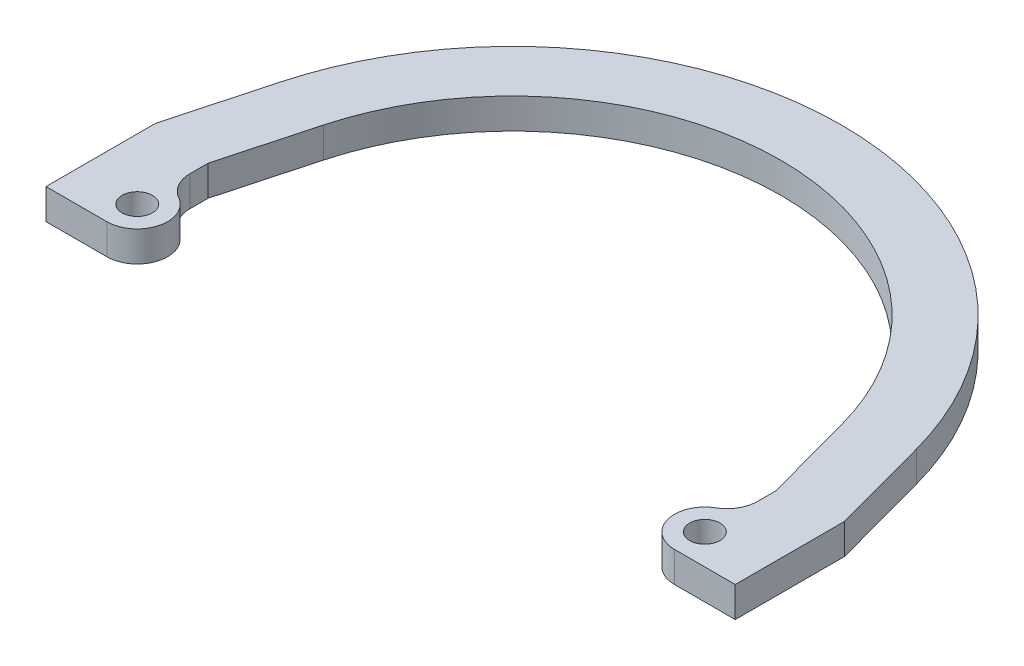
ISO-10303-21;
HEADER;
FILE_DESCRIPTION(('STEP AP214'),'2;1');
FILE_NAME('part.step','',(''),(''),'','','');
FILE_SCHEMA(('AUTOMOTIVE_DESIGN { 1 0 10303 214 1 1 1 1 }'));
ENDSEC;
DATA;
#1=APPLICATION_CONTEXT('core data for automotive mechanical design processes');
#2=APPLICATION_PROTOCOL_DEFINITION('international standard','automotive_design',2000,#1);
#3=PRODUCT_CONTEXT('',#1,'mechanical');
#4=PRODUCT('Part','Part','',(#3));
#5=PRODUCT_RELATED_PRODUCT_CATEGORY('part','',(#4));
#6=PRODUCT_DEFINITION_FORMATION('','',#4);
#7=PRODUCT_DEFINITION_CONTEXT('part definition',#1,'design');
#8=PRODUCT_DEFINITION('design','',#6,#7);
#9=PRODUCT_DEFINITION_SHAPE('','',#8);
#10=(LENGTH_UNIT() NAMED_UNIT(*) SI_UNIT(.MILLI.,.METRE.));
#11=(NAMED_UNIT(*) PLANE_ANGLE_UNIT() SI_UNIT($,.RADIAN.));
#12=(NAMED_UNIT(*) SI_UNIT($,.STERADIAN.) SOLID_ANGLE_UNIT());
#13=UNCERTAINTY_MEASURE_WITH_UNIT(LENGTH_MEASURE(1.E-05),#10,'distance_accuracy_value','');
#14=(GEOMETRIC_REPRESENTATION_CONTEXT(3) GLOBAL_UNCERTAINTY_ASSIGNED_CONTEXT((#13)) GLOBAL_UNIT_ASSIGNED_CONTEXT((#10,
#11,#12)) REPRESENTATION_CONTEXT('',''));
#15=CARTESIAN_POINT('',(0.,0.,0.));
#16=DIRECTION('',(0.,0.,1.));
#17=DIRECTION('',(1.,0.,0.));
#18=AXIS2_PLACEMENT_3D('',#15,#16,#17);
#19=CARTESIAN_POINT('',(0.,3.,0.));
#20=DIRECTION('',(0.,-1.,0.));
#21=DIRECTION('',(0.,0.,-1.));
#22=AXIS2_PLACEMENT_3D('',#19,#20,#21);
#23=PLANE('',#22);
#24=CARTESIAN_POINT('',(-28.,3.,9.));
#25=DIRECTION('',(0.,1.,0.));
#26=DIRECTION('',(0.,0.,1.));
#27=AXIS2_PLACEMENT_3D('',#24,#25,#26);
#28=CIRCLE('',#27,1.5);
#29=CARTESIAN_POINT('',(-28.,3.,10.5));
#30=VERTEX_POINT('',#29);
#31=EDGE_CURVE('E156',#30,#30,#28,.T.);
#32=ORIENTED_EDGE('',*,*,#31,.F.);
#33=EDGE_LOOP('',(#32));
#34=FACE_BOUND('',#33,.T.);
#35=DIRECTION('',(1.,0.,0.));
#36=VECTOR('',#35,1.);
#37=CARTESIAN_POINT('',(29.1,3.,12.));
#38=LINE('',#37,#36);
#39=CARTESIAN_POINT('',(28.,3.,12.));
#40=VERTEX_POINT('',#39);
#41=CARTESIAN_POINT('',(34.,3.,12.));
#42=VERTEX_POINT('',#41);
#43=EDGE_CURVE('E223',#40,#42,#38,.T.);
#44=ORIENTED_EDGE('',*,*,#43,.T.);
#45=DIRECTION('',(0.,0.,-1.));
#46=VECTOR('',#45,1.);
#47=CARTESIAN_POINT('',(34.,3.,12.));
#48=LINE('',#47,#46);
#49=CARTESIAN_POINT('',(34.,3.,1.20071967830535));
#50=VERTEX_POINT('',#49);
#51=EDGE_CURVE('E209',#42,#50,#48,.T.);
#52=ORIENTED_EDGE('',*,*,#51,.T.);
#53=DIRECTION('',(-0.261781254421739,0.,-0.965127232458695));
#54=VECTOR('',#53,1.);
#55=CARTESIAN_POINT('',(34.,3.,1.20071967830535));
#56=LINE('',#55,#54);
#57=CARTESIAN_POINT('',(31.3666350549076,3.,-8.5078907687065));
#58=VERTEX_POINT('',#57);
#59=EDGE_CURVE('E212',#50,#58,#56,.T.);
#60=ORIENTED_EDGE('',*,*,#59,.T.);
#61=CARTESIAN_POINT('',(0.,3.,0.));
#62=DIRECTION('',(0.,1.,0.));
#63=DIRECTION('',(0.,0.,-1.));
#64=AXIS2_PLACEMENT_3D('',#61,#62,#63);
#65=CIRCLE('',#64,32.5);
#66=CARTESIAN_POINT('',(-31.3666350549076,3.,-8.5078907687065));
#67=VERTEX_POINT('',#66);
#68=EDGE_CURVE('E215',#58,#67,#65,.T.);
#69=ORIENTED_EDGE('',*,*,#68,.T.);
#70=DIRECTION('',(0.261781254421739,0.,-0.965127232458695));
#71=VECTOR('',#70,1.);
#72=CARTESIAN_POINT('',(-34.,3.,1.20071967830535));
#73=LINE('',#72,#71);
#74=CARTESIAN_POINT('',(-34.,3.,1.20071967830535));
#75=VERTEX_POINT('',#74);
#76=EDGE_CURVE('E174',#75,#67,#73,.T.);
#77=ORIENTED_EDGE('',*,*,#76,.F.);
#78=DIRECTION('',(0.,0.,-1.));
#79=VECTOR('',#78,1.);
#80=CARTESIAN_POINT('',(-34.,3.,12.));
#81=LINE('',#80,#79);
#82=CARTESIAN_POINT('',(-34.,3.,12.));
#83=VERTEX_POINT('',#82);
#84=EDGE_CURVE('E170',#83,#75,#81,.T.);
#85=ORIENTED_EDGE('',*,*,#84,.F.);
#86=DIRECTION('',(-1.,0.,0.));
#87=VECTOR('',#86,1.);
#88=CARTESIAN_POINT('',(-29.1,3.,12.));
#89=LINE('',#88,#87);
#90=CARTESIAN_POINT('',(-28.,3.,12.));
#91=VERTEX_POINT('',#90);
#92=EDGE_CURVE('E180',#91,#83,#89,.T.);
#93=ORIENTED_EDGE('',*,*,#92,.F.);
#94=CARTESIAN_POINT('',(-28.,3.,9.));
#95=DIRECTION('',(0.,1.,0.));
#96=DIRECTION('',(0.,0.,-1.));
#97=AXIS2_PLACEMENT_3D('',#94,#95,#96);
#98=CIRCLE('',#97,3.);
#99=CARTESIAN_POINT('',(-26.5,3.,6.40192378864668));
#100=VERTEX_POINT('',#99);
#101=EDGE_CURVE('E155',#91,#100,#98,.T.);
#102=ORIENTED_EDGE('',*,*,#101,.T.);
#103=CARTESIAN_POINT('',(-25.,3.,3.80384757729337));
#104=DIRECTION('',(0.,1.,0.));
#105=DIRECTION('',(0.,0.,-1.));
#106=AXIS2_PLACEMENT_3D('',#103,#104,#105);
#107=CIRCLE('',#106,3.);
#108=CARTESIAN_POINT('',(-28.,3.,3.80384757729337));
#109=VERTEX_POINT('',#108);
#110=EDGE_CURVE('E199',#109,#100,#107,.T.);
#111=ORIENTED_EDGE('',*,*,#110,.F.);
#112=DIRECTION('',(0.,0.,1.));
#113=VECTOR('',#112,1.);
#114=CARTESIAN_POINT('',(-28.,3.,12.));
#115=LINE('',#114,#113);
#116=CARTESIAN_POINT('',(-28.,3.,2.));
#117=VERTEX_POINT('',#116);
#118=EDGE_CURVE('E510',#117,#109,#115,.T.);
#119=ORIENTED_EDGE('',*,*,#118,.F.);
#120=DIRECTION('',(-0.261781254421738,0.,0.965127232458696));
#121=VECTOR('',#120,1.);
#122=CARTESIAN_POINT('',(-28.,3.,2.));
#123=LINE('',#122,#121);
#124=CARTESIAN_POINT('',(-25.5758716601554,3.,-6.93720324217607));
#125=VERTEX_POINT('',#124);
#126=EDGE_CURVE('E508',#125,#117,#123,.T.);
#127=ORIENTED_EDGE('',*,*,#126,.F.);
#128=CARTESIAN_POINT('',(0.,3.,0.));
#129=DIRECTION('',(0.,-1.,0.));
#130=DIRECTION('',(0.,0.,-1.));
#131=AXIS2_PLACEMENT_3D('',#128,#129,#130);
#132=CIRCLE('',#131,26.5);
#133=CARTESIAN_POINT('',(25.5758716601554,3.,-6.93720324217607));
#134=VERTEX_POINT('',#133);
#135=EDGE_CURVE('E217',#125,#134,#132,.T.);
#136=ORIENTED_EDGE('',*,*,#135,.T.);
#137=DIRECTION('',(0.261781254421738,0.,0.965127232458696));
#138=VECTOR('',#137,1.);
#139=CARTESIAN_POINT('',(28.,3.,2.));
#140=LINE('',#139,#138);
#141=CARTESIAN_POINT('',(28.,3.,2.));
#142=VERTEX_POINT('',#141);
#143=EDGE_CURVE('E219',#134,#142,#140,.T.);
#144=ORIENTED_EDGE('',*,*,#143,.T.);
#145=DIRECTION('',(0.,0.,1.));
#146=VECTOR('',#145,1.);
#147=CARTESIAN_POINT('',(28.,3.,12.));
#148=LINE('',#147,#146);
#149=CARTESIAN_POINT('',(28.,3.,3.80384757729337));
#150=VERTEX_POINT('',#149);
#151=EDGE_CURVE('E221',#142,#150,#148,.T.);
#152=ORIENTED_EDGE('',*,*,#151,.T.);
#153=CARTESIAN_POINT('',(25.,3.,3.80384757729337));
#154=DIRECTION('',(0.,-1.,0.));
#155=DIRECTION('',(0.,0.,-1.));
#156=AXIS2_PLACEMENT_3D('',#153,#154,#155);
#157=CIRCLE('',#156,3.);
#158=CARTESIAN_POINT('',(26.5,3.,6.40192378864668));
#159=VERTEX_POINT('',#158);
#160=EDGE_CURVE('E11',#150,#159,#157,.T.);
#161=ORIENTED_EDGE('',*,*,#160,.T.);
#162=CARTESIAN_POINT('',(28.,3.,9.));
#163=DIRECTION('',(0.,-1.,0.));
#164=DIRECTION('',(0.,0.,-1.));
#165=AXIS2_PLACEMENT_3D('',#162,#163,#164);
#166=CIRCLE('',#165,3.);
#167=EDGE_CURVE('E203',#40,#159,#166,.T.);
#168=ORIENTED_EDGE('',*,*,#167,.F.);
#169=EDGE_LOOP('',(#44,#52,#60,#69,#77,#85,#93,#102,#111,#119,#127,#136,#144,#152,#161,#168));
#170=FACE_BOUND('',#169,.T.);
#171=CARTESIAN_POINT('',(28.,3.,9.));
#172=DIRECTION('',(0.,1.,0.));
#173=DIRECTION('',(0.,0.,1.));
#174=AXIS2_PLACEMENT_3D('',#171,#172,#173);
#175=CIRCLE('',#174,1.5);
#176=CARTESIAN_POINT('',(28.,3.,10.5));
#177=VERTEX_POINT('',#176);
#178=EDGE_CURVE('E492',#177,#177,#175,.T.);
#179=ORIENTED_EDGE('',*,*,#178,.F.);
#180=EDGE_LOOP('',(#179));
#181=FACE_BOUND('',#180,.T.);
#182=ADVANCED_FACE('F32',(#34,#170,#181),#23,.F.);
#183=CARTESIAN_POINT('',(0.,0.,0.));
#184=DIRECTION('',(0.,-1.,0.));
#185=DIRECTION('',(0.,0.,-1.));
#186=AXIS2_PLACEMENT_3D('',#183,#184,#185);
#187=PLANE('',#186);
#188=CARTESIAN_POINT('',(-28.,0.,9.));
#189=DIRECTION('',(0.,1.,0.));
#190=DIRECTION('',(0.,0.,1.));
#191=AXIS2_PLACEMENT_3D('',#188,#189,#190);
#192=CIRCLE('',#191,1.5);
#193=CARTESIAN_POINT('',(-28.,0.,10.5));
#194=VERTEX_POINT('',#193);
#195=EDGE_CURVE('E497',#194,#194,#192,.T.);
#196=ORIENTED_EDGE('',*,*,#195,.T.);
#197=EDGE_LOOP('',(#196));
#198=FACE_BOUND('',#197,.T.);
#199=DIRECTION('',(1.,0.,0.));
#200=VECTOR('',#199,1.);
#201=CARTESIAN_POINT('',(32.9,0.,12.));
#202=LINE('',#201,#200);
#203=CARTESIAN_POINT('',(28.,0.,12.));
#204=VERTEX_POINT('',#203);
#205=CARTESIAN_POINT('',(34.,0.,12.));
#206=VERTEX_POINT('',#205);
#207=EDGE_CURVE('E213',#204,#206,#202,.T.);
#208=ORIENTED_EDGE('',*,*,#207,.F.);
#209=CARTESIAN_POINT('',(28.,0.,9.));
#210=DIRECTION('',(0.,1.,0.));
#211=DIRECTION('',(0.,0.,-1.));
#212=AXIS2_PLACEMENT_3D('',#209,#210,#211);
#213=CIRCLE('',#212,3.);
#214=CARTESIAN_POINT('',(26.5,0.,6.40192378864668));
#215=VERTEX_POINT('',#214);
#216=EDGE_CURVE('E202',#215,#204,#213,.T.);
#217=ORIENTED_EDGE('',*,*,#216,.F.);
#218=CARTESIAN_POINT('',(25.,0.,3.80384757729337));
#219=DIRECTION('',(0.,-1.,0.));
#220=DIRECTION('',(0.,0.,-1.));
#221=AXIS2_PLACEMENT_3D('',#218,#219,#220);
#222=CIRCLE('',#221,3.);
#223=CARTESIAN_POINT('',(28.,0.,3.80384757729337));
#224=VERTEX_POINT('',#223);
#225=EDGE_CURVE('E40',#215,#224,#222,.F.);
#226=ORIENTED_EDGE('',*,*,#225,.T.);
#227=DIRECTION('',(0.,0.,1.));
#228=VECTOR('',#227,1.);
#229=CARTESIAN_POINT('',(28.,0.,12.));
#230=LINE('',#229,#228);
#231=CARTESIAN_POINT('',(28.,0.,2.));
#232=VERTEX_POINT('',#231);
#233=EDGE_CURVE('E236',#232,#224,#230,.T.);
#234=ORIENTED_EDGE('',*,*,#233,.F.);
#235=DIRECTION('',(0.261781254421738,0.,0.965127232458696));
#236=VECTOR('',#235,1.);
#237=CARTESIAN_POINT('',(28.,0.,2.));
#238=LINE('',#237,#236);
#239=CARTESIAN_POINT('',(25.5758716601554,0.,-6.93720324217607));
#240=VERTEX_POINT('',#239);
#241=EDGE_CURVE('E234',#240,#232,#238,.T.);
#242=ORIENTED_EDGE('',*,*,#241,.F.);
#243=CARTESIAN_POINT('',(0.,0.,0.));
#244=DIRECTION('',(0.,-1.,0.));
#245=DIRECTION('',(0.,0.,-1.));
#246=AXIS2_PLACEMENT_3D('',#243,#244,#245);
#247=CIRCLE('',#246,26.5);
#248=CARTESIAN_POINT('',(-25.5758716601554,0.,-6.93720324217607));
#249=VERTEX_POINT('',#248);
#250=EDGE_CURVE('E232',#249,#240,#247,.T.);
#251=ORIENTED_EDGE('',*,*,#250,.F.);
#252=DIRECTION('',(-0.261781254421738,0.,0.965127232458696));
#253=VECTOR('',#252,1.);
#254=CARTESIAN_POINT('',(-28.,0.,2.));
#255=LINE('',#254,#253);
#256=CARTESIAN_POINT('',(-28.,0.,2.));
#257=VERTEX_POINT('',#256);
#258=EDGE_CURVE('E176',#249,#257,#255,.T.);
#259=ORIENTED_EDGE('',*,*,#258,.T.);
#260=DIRECTION('',(0.,0.,1.));
#261=VECTOR('',#260,1.);
#262=CARTESIAN_POINT('',(-28.,0.,12.));
#263=LINE('',#262,#261);
#264=CARTESIAN_POINT('',(-28.,0.,3.80384757729337));
#265=VERTEX_POINT('',#264);
#266=EDGE_CURVE('E171',#257,#265,#263,.T.);
#267=ORIENTED_EDGE('',*,*,#266,.T.);
#268=CARTESIAN_POINT('',(-25.,0.,3.80384757729337));
#269=DIRECTION('',(0.,1.,0.));
#270=DIRECTION('',(0.,0.,-1.));
#271=AXIS2_PLACEMENT_3D('',#268,#269,#270);
#272=CIRCLE('',#271,3.);
#273=CARTESIAN_POINT('',(-26.5,0.,6.40192378864668));
#274=VERTEX_POINT('',#273);
#275=EDGE_CURVE('E153',#274,#265,#272,.F.);
#276=ORIENTED_EDGE('',*,*,#275,.F.);
#277=CARTESIAN_POINT('',(-28.,0.,9.));
#278=DIRECTION('',(0.,-1.,0.));
#279=DIRECTION('',(0.,0.,-1.));
#280=AXIS2_PLACEMENT_3D('',#277,#278,#279);
#281=CIRCLE('',#280,3.);
#282=CARTESIAN_POINT('',(-28.,0.,12.));
#283=VERTEX_POINT('',#282);
#284=EDGE_CURVE('E144',#274,#283,#281,.T.);
#285=ORIENTED_EDGE('',*,*,#284,.T.);
#286=DIRECTION('',(-1.,0.,0.));
#287=VECTOR('',#286,1.);
#288=CARTESIAN_POINT('',(-29.1,0.,12.));
#289=LINE('',#288,#287);
#290=CARTESIAN_POINT('',(-34.,0.,12.));
#291=VERTEX_POINT('',#290);
#292=EDGE_CURVE('E150',#283,#291,#289,.T.);
#293=ORIENTED_EDGE('',*,*,#292,.T.);
#294=DIRECTION('',(0.,0.,-1.));
#295=VECTOR('',#294,1.);
#296=CARTESIAN_POINT('',(-34.,0.,12.));
#297=LINE('',#296,#295);
#298=CARTESIAN_POINT('',(-34.,0.,1.20071967830535));
#299=VERTEX_POINT('',#298);
#300=EDGE_CURVE('E504',#291,#299,#297,.T.);
#301=ORIENTED_EDGE('',*,*,#300,.T.);
#302=DIRECTION('',(0.261781254421739,0.,-0.965127232458695));
#303=VECTOR('',#302,1.);
#304=CARTESIAN_POINT('',(-34.,0.,1.20071967830535));
#305=LINE('',#304,#303);
#306=CARTESIAN_POINT('',(-31.3666350549076,0.,-8.5078907687065));
#307=VERTEX_POINT('',#306);
#308=EDGE_CURVE('E515',#299,#307,#305,.T.);
#309=ORIENTED_EDGE('',*,*,#308,.T.);
#310=CARTESIAN_POINT('',(0.,0.,0.));
#311=DIRECTION('',(0.,1.,0.));
#312=DIRECTION('',(0.,0.,-1.));
#313=AXIS2_PLACEMENT_3D('',#310,#311,#312);
#314=CIRCLE('',#313,32.5);
#315=CARTESIAN_POINT('',(31.3666350549076,0.,-8.5078907687065));
#316=VERTEX_POINT('',#315);
#317=EDGE_CURVE('E230',#316,#307,#314,.T.);
#318=ORIENTED_EDGE('',*,*,#317,.F.);
#319=DIRECTION('',(-0.261781254421739,0.,-0.965127232458695));
#320=VECTOR('',#319,1.);
#321=CARTESIAN_POINT('',(34.,0.,1.20071967830535));
#322=LINE('',#321,#320);
#323=CARTESIAN_POINT('',(34.,0.,1.20071967830535));
#324=VERTEX_POINT('',#323);
#325=EDGE_CURVE('E228',#324,#316,#322,.T.);
#326=ORIENTED_EDGE('',*,*,#325,.F.);
#327=DIRECTION('',(0.,0.,-1.));
#328=VECTOR('',#327,1.);
#329=CARTESIAN_POINT('',(34.,0.,12.));
#330=LINE('',#329,#328);
#331=EDGE_CURVE('E206',#206,#324,#330,.T.);
#332=ORIENTED_EDGE('',*,*,#331,.F.);
#333=EDGE_LOOP('',(#208,#217,#226,#234,#242,#251,#259,#267,#276,#285,#293,#301,#309,#318,#326,#332));
#334=FACE_BOUND('',#333,.T.);
#335=CARTESIAN_POINT('',(28.,0.,9.));
#336=DIRECTION('',(0.,1.,0.));
#337=DIRECTION('',(0.,0.,1.));
#338=AXIS2_PLACEMENT_3D('',#335,#336,#337);
#339=CIRCLE('',#338,1.5);
#340=CARTESIAN_POINT('',(28.,0.,10.5));
#341=VERTEX_POINT('',#340);
#342=EDGE_CURVE('E495',#341,#341,#339,.T.);
#343=ORIENTED_EDGE('',*,*,#342,.T.);
#344=EDGE_LOOP('',(#343));
#345=FACE_BOUND('',#344,.T.);
#346=ADVANCED_FACE('F146',(#198,#334,#345),#187,.T.);
#347=CARTESIAN_POINT('',(28.,3.,12.));
#348=DIRECTION('',(1.,0.,0.));
#349=DIRECTION('',(0.,0.,-1.));
#350=AXIS2_PLACEMENT_3D('',#347,#348,#349);
#351=PLANE('',#350);
#352=ORIENTED_EDGE('',*,*,#233,.T.);
#353=DIRECTION('',(0.,1.,0.));
#354=VECTOR('',#353,1.);
#355=CARTESIAN_POINT('',(28.,3.,3.80384757729337));
#356=LINE('',#355,#354);
#357=EDGE_CURVE('E53',#224,#150,#356,.T.);
#358=ORIENTED_EDGE('',*,*,#357,.T.);
#359=ORIENTED_EDGE('',*,*,#151,.F.);
#360=DIRECTION('',(0.,-1.,0.));
#361=VECTOR('',#360,1.);
#362=CARTESIAN_POINT('',(28.,3.,2.));
#363=LINE('',#362,#361);
#364=EDGE_CURVE('E244',#142,#232,#363,.T.);
#365=ORIENTED_EDGE('',*,*,#364,.T.);
#366=EDGE_LOOP('',(#352,#358,#359,#365));
#367=FACE_BOUND('',#366,.T.);
#368=ADVANCED_FACE('F295',(#367),#351,.F.);
#369=CARTESIAN_POINT('',(34.,3.,12.));
#370=DIRECTION('',(-1.,0.,0.));
#371=DIRECTION('',(0.,0.,1.));
#372=AXIS2_PLACEMENT_3D('',#369,#370,#371);
#373=PLANE('',#372);
#374=ORIENTED_EDGE('',*,*,#331,.T.);
#375=DIRECTION('',(0.,-1.,0.));
#376=VECTOR('',#375,1.);
#377=CARTESIAN_POINT('',(34.,3.,1.20071967830535));
#378=LINE('',#377,#376);
#379=EDGE_CURVE('E253',#50,#324,#378,.T.);
#380=ORIENTED_EDGE('',*,*,#379,.F.);
#381=ORIENTED_EDGE('',*,*,#51,.F.);
#382=DIRECTION('',(0.,-1.,0.));
#383=VECTOR('',#382,1.);
#384=CARTESIAN_POINT('',(34.,3.,12.));
#385=LINE('',#384,#383);
#386=EDGE_CURVE('E225',#42,#206,#385,.T.);
#387=ORIENTED_EDGE('',*,*,#386,.T.);
#388=EDGE_LOOP('',(#374,#380,#381,#387));
#389=FACE_BOUND('',#388,.T.);
#390=ADVANCED_FACE('F272',(#389),#373,.F.);
#391=CARTESIAN_POINT('',(34.,3.,1.20071967830535));
#392=DIRECTION('',(-0.965127232458696,0.,0.261781254421739));
#393=DIRECTION('',(0.261781254421739,0.,0.965127232458696));
#394=AXIS2_PLACEMENT_3D('',#391,#392,#393);
#395=PLANE('',#394);
#396=ORIENTED_EDGE('',*,*,#325,.T.);
#397=DIRECTION('',(0.,-1.,0.));
#398=VECTOR('',#397,1.);
#399=CARTESIAN_POINT('',(31.3666350549076,3.,-8.5078907687065));
#400=LINE('',#399,#398);
#401=EDGE_CURVE('E250',#58,#316,#400,.T.);
#402=ORIENTED_EDGE('',*,*,#401,.F.);
#403=ORIENTED_EDGE('',*,*,#59,.F.);
#404=ORIENTED_EDGE('',*,*,#379,.T.);
#405=EDGE_LOOP('',(#396,#402,#403,#404));
#406=FACE_BOUND('',#405,.T.);
#407=ADVANCED_FACE('F316',(#406),#395,.F.);
#408=CARTESIAN_POINT('',(0.,3.,0.));
#409=DIRECTION('',(0.,-1.,0.));
#410=DIRECTION('',(0.,0.,-1.));
#411=AXIS2_PLACEMENT_3D('',#408,#409,#410);
#412=CYLINDRICAL_SURFACE('',#411,32.5);
#413=ORIENTED_EDGE('',*,*,#317,.T.);
#414=DIRECTION('',(0.,-1.,0.));
#415=VECTOR('',#414,1.);
#416=CARTESIAN_POINT('',(-31.3666350549076,3.,-8.5078907687065));
#417=LINE('',#416,#415);
#418=EDGE_CURVE('E187',#67,#307,#417,.T.);
#419=ORIENTED_EDGE('',*,*,#418,.F.);
#420=ORIENTED_EDGE('',*,*,#68,.F.);
#421=ORIENTED_EDGE('',*,*,#401,.T.);
#422=EDGE_LOOP('',(#413,#419,#420,#421));
#423=FACE_BOUND('',#422,.T.);
#424=ADVANCED_FACE('F312',(#423),#412,.T.);
#425=CARTESIAN_POINT('',(0.,3.,0.));
#426=DIRECTION('',(0.,-1.,0.));
#427=DIRECTION('',(0.,0.,-1.));
#428=AXIS2_PLACEMENT_3D('',#425,#426,#427);
#429=CYLINDRICAL_SURFACE('',#428,26.5);
#430=ORIENTED_EDGE('',*,*,#250,.T.);
#431=DIRECTION('',(0.,-1.,0.));
#432=VECTOR('',#431,1.);
#433=CARTESIAN_POINT('',(25.5758716601554,3.,-6.93720324217607));
#434=LINE('',#433,#432);
#435=EDGE_CURVE('E247',#134,#240,#434,.T.);
#436=ORIENTED_EDGE('',*,*,#435,.F.);
#437=ORIENTED_EDGE('',*,*,#135,.F.);
#438=DIRECTION('',(0.,-1.,0.));
#439=VECTOR('',#438,1.);
#440=CARTESIAN_POINT('',(-25.5758716601554,3.,-6.93720324217607));
#441=LINE('',#440,#439);
#442=EDGE_CURVE('E184',#125,#249,#441,.T.);
#443=ORIENTED_EDGE('',*,*,#442,.T.);
#444=EDGE_LOOP('',(#430,#436,#437,#443));
#445=FACE_BOUND('',#444,.T.);
#446=ADVANCED_FACE('F308',(#445),#429,.F.);
#447=CARTESIAN_POINT('',(28.,3.,2.));
#448=DIRECTION('',(0.965127232458696,0.,-0.261781254421738));
#449=DIRECTION('',(-0.261781254421738,0.,-0.965127232458696));
#450=AXIS2_PLACEMENT_3D('',#447,#448,#449);
#451=PLANE('',#450);
#452=ORIENTED_EDGE('',*,*,#241,.T.);
#453=ORIENTED_EDGE('',*,*,#364,.F.);
#454=ORIENTED_EDGE('',*,*,#143,.F.);
#455=ORIENTED_EDGE('',*,*,#435,.T.);
#456=EDGE_LOOP('',(#452,#453,#454,#455));
#457=FACE_BOUND('',#456,.T.);
#458=ADVANCED_FACE('F303',(#457),#451,.F.);
#459=CARTESIAN_POINT('',(32.9,3.,12.));
#460=DIRECTION('',(0.,0.,-1.));
#461=DIRECTION('',(-1.,0.,0.));
#462=AXIS2_PLACEMENT_3D('',#459,#460,#461);
#463=PLANE('',#462);
#464=ORIENTED_EDGE('',*,*,#207,.T.);
#465=ORIENTED_EDGE('',*,*,#386,.F.);
#466=ORIENTED_EDGE('',*,*,#43,.F.);
#467=DIRECTION('',(0.,-1.,0.));
#468=VECTOR('',#467,1.);
#469=CARTESIAN_POINT('',(28.,3.,12.));
#470=LINE('',#469,#468);
#471=EDGE_CURVE('E241',#40,#204,#470,.T.);
#472=ORIENTED_EDGE('',*,*,#471,.T.);
#473=EDGE_LOOP('',(#464,#465,#466,#472));
#474=FACE_BOUND('',#473,.T.);
#475=ADVANCED_FACE('F269',(#474),#463,.F.);
#476=CARTESIAN_POINT('',(28.,9.70820393249937,9.));
#477=DIRECTION('',(0.,-1.,0.));
#478=DIRECTION('',(0.,0.,-1.));
#479=AXIS2_PLACEMENT_3D('',#476,#477,#478);
#480=CYLINDRICAL_SURFACE('',#479,3.);
#481=ORIENTED_EDGE('',*,*,#167,.T.);
#482=DIRECTION('',(0.,-1.,0.));
#483=VECTOR('',#482,1.);
#484=CARTESIAN_POINT('',(26.5,9.70820393249937,6.40192378864668));
#485=LINE('',#484,#483);
#486=EDGE_CURVE('E256',#159,#215,#485,.T.);
#487=ORIENTED_EDGE('',*,*,#486,.T.);
#488=ORIENTED_EDGE('',*,*,#216,.T.);
#489=ORIENTED_EDGE('',*,*,#471,.F.);
#490=EDGE_LOOP('',(#481,#487,#488,#489));
#491=FACE_BOUND('',#490,.T.);
#492=ADVANCED_FACE('F261',(#491),#480,.T.);
#493=CARTESIAN_POINT('',(25.,9.70820393249937,3.80384757729337));
#494=DIRECTION('',(0.,-1.,0.));
#495=DIRECTION('',(0.,0.,-1.));
#496=AXIS2_PLACEMENT_3D('',#493,#494,#495);
#497=CYLINDRICAL_SURFACE('',#496,3.);
#498=ORIENTED_EDGE('',*,*,#160,.F.);
#499=ORIENTED_EDGE('',*,*,#357,.F.);
#500=ORIENTED_EDGE('',*,*,#225,.F.);
#501=ORIENTED_EDGE('',*,*,#486,.F.);
#502=EDGE_LOOP('',(#498,#499,#500,#501));
#503=FACE_BOUND('',#502,.T.);
#504=ADVANCED_FACE('F34',(#503),#497,.F.);
#505=CARTESIAN_POINT('',(-28.,3.,12.));
#506=DIRECTION('',(-1.,0.,0.));
#507=DIRECTION('',(0.,0.,-1.));
#508=AXIS2_PLACEMENT_3D('',#505,#506,#507);
#509=PLANE('',#508);
#510=ORIENTED_EDGE('',*,*,#266,.F.);
#511=DIRECTION('',(0.,-1.,0.));
#512=VECTOR('',#511,1.);
#513=CARTESIAN_POINT('',(-28.,3.,2.));
#514=LINE('',#513,#512);
#515=EDGE_CURVE('E164',#117,#257,#514,.T.);
#516=ORIENTED_EDGE('',*,*,#515,.F.);
#517=ORIENTED_EDGE('',*,*,#118,.T.);
#518=DIRECTION('',(0.,1.,0.));
#519=VECTOR('',#518,1.);
#520=CARTESIAN_POINT('',(-28.,3.,3.80384757729337));
#521=LINE('',#520,#519);
#522=EDGE_CURVE('E195',#265,#109,#521,.T.);
#523=ORIENTED_EDGE('',*,*,#522,.F.);
#524=EDGE_LOOP('',(#510,#516,#517,#523));
#525=FACE_BOUND('',#524,.T.);
#526=ADVANCED_FACE('F278',(#525),#509,.F.);
#527=CARTESIAN_POINT('',(-34.,3.,12.));
#528=DIRECTION('',(1.,0.,0.));
#529=DIRECTION('',(0.,0.,1.));
#530=AXIS2_PLACEMENT_3D('',#527,#528,#529);
#531=PLANE('',#530);
#532=ORIENTED_EDGE('',*,*,#300,.F.);
#533=DIRECTION('',(0.,-1.,0.));
#534=VECTOR('',#533,1.);
#535=CARTESIAN_POINT('',(-34.,3.,12.));
#536=LINE('',#535,#534);
#537=EDGE_CURVE('E165',#83,#291,#536,.T.);
#538=ORIENTED_EDGE('',*,*,#537,.F.);
#539=ORIENTED_EDGE('',*,*,#84,.T.);
#540=DIRECTION('',(0.,-1.,0.));
#541=VECTOR('',#540,1.);
#542=CARTESIAN_POINT('',(-34.,3.,1.20071967830535));
#543=LINE('',#542,#541);
#544=EDGE_CURVE('E190',#75,#299,#543,.T.);
#545=ORIENTED_EDGE('',*,*,#544,.T.);
#546=EDGE_LOOP('',(#532,#538,#539,#545));
#547=FACE_BOUND('',#546,.T.);
#548=ADVANCED_FACE('F284',(#547),#531,.F.);
#549=CARTESIAN_POINT('',(-34.,3.,1.20071967830535));
#550=DIRECTION('',(0.965127232458696,0.,0.261781254421739));
#551=DIRECTION('',(-0.261781254421739,0.,0.965127232458696));
#552=AXIS2_PLACEMENT_3D('',#549,#550,#551);
#553=PLANE('',#552);
#554=ORIENTED_EDGE('',*,*,#308,.F.);
#555=ORIENTED_EDGE('',*,*,#544,.F.);
#556=ORIENTED_EDGE('',*,*,#76,.T.);
#557=ORIENTED_EDGE('',*,*,#418,.T.);
#558=EDGE_LOOP('',(#554,#555,#556,#557));
#559=FACE_BOUND('',#558,.T.);
#560=ADVANCED_FACE('F391',(#559),#553,.F.);
#561=CARTESIAN_POINT('',(-28.,3.,2.));
#562=DIRECTION('',(-0.965127232458696,0.,-0.261781254421738));
#563=DIRECTION('',(0.261781254421738,0.,-0.965127232458696));
#564=AXIS2_PLACEMENT_3D('',#561,#562,#563);
#565=PLANE('',#564);
#566=ORIENTED_EDGE('',*,*,#258,.F.);
#567=ORIENTED_EDGE('',*,*,#442,.F.);
#568=ORIENTED_EDGE('',*,*,#126,.T.);
#569=ORIENTED_EDGE('',*,*,#515,.T.);
#570=EDGE_LOOP('',(#566,#567,#568,#569));
#571=FACE_BOUND('',#570,.T.);
#572=ADVANCED_FACE('F400',(#571),#565,.F.);
#573=CARTESIAN_POINT('',(-29.1,3.,12.));
#574=DIRECTION('',(0.,0.,-1.));
#575=DIRECTION('',(1.,0.,0.));
#576=AXIS2_PLACEMENT_3D('',#573,#574,#575);
#577=PLANE('',#576);
#578=ORIENTED_EDGE('',*,*,#292,.F.);
#579=DIRECTION('',(0.,-1.,0.));
#580=VECTOR('',#579,1.);
#581=CARTESIAN_POINT('',(-28.,3.,12.));
#582=LINE('',#581,#580);
#583=EDGE_CURVE('E159',#91,#283,#582,.T.);
#584=ORIENTED_EDGE('',*,*,#583,.F.);
#585=ORIENTED_EDGE('',*,*,#92,.T.);
#586=ORIENTED_EDGE('',*,*,#537,.T.);
#587=EDGE_LOOP('',(#578,#584,#585,#586));
#588=FACE_BOUND('',#587,.T.);
#589=ADVANCED_FACE('F167',(#588),#577,.F.);
#590=CARTESIAN_POINT('',(-28.,9.70820393249937,9.));
#591=DIRECTION('',(0.,-1.,0.));
#592=DIRECTION('',(0.,0.,-1.));
#593=AXIS2_PLACEMENT_3D('',#590,#591,#592);
#594=CYLINDRICAL_SURFACE('',#593,3.);
#595=ORIENTED_EDGE('',*,*,#101,.F.);
#596=ORIENTED_EDGE('',*,*,#583,.T.);
#597=ORIENTED_EDGE('',*,*,#284,.F.);
#598=DIRECTION('',(0.,-1.,0.));
#599=VECTOR('',#598,1.);
#600=CARTESIAN_POINT('',(-26.5,9.70820393249937,6.40192378864668));
#601=LINE('',#600,#599);
#602=EDGE_CURVE('E193',#100,#274,#601,.T.);
#603=ORIENTED_EDGE('',*,*,#602,.F.);
#604=EDGE_LOOP('',(#595,#596,#597,#603));
#605=FACE_BOUND('',#604,.T.);
#606=ADVANCED_FACE('F160',(#605),#594,.T.);
#607=CARTESIAN_POINT('',(-25.,9.70820393249937,3.80384757729337));
#608=DIRECTION('',(0.,-1.,0.));
#609=DIRECTION('',(0.,0.,-1.));
#610=AXIS2_PLACEMENT_3D('',#607,#608,#609);
#611=CYLINDRICAL_SURFACE('',#610,3.);
#612=ORIENTED_EDGE('',*,*,#110,.T.);
#613=ORIENTED_EDGE('',*,*,#602,.T.);
#614=ORIENTED_EDGE('',*,*,#275,.T.);
#615=ORIENTED_EDGE('',*,*,#522,.T.);
#616=EDGE_LOOP('',(#612,#613,#614,#615));
#617=FACE_BOUND('',#616,.T.);
#618=ADVANCED_FACE('F413',(#617),#611,.F.);
#619=CARTESIAN_POINT('',(-28.,3.,9.));
#620=DIRECTION('',(0.,-1.,0.));
#621=DIRECTION('',(0.,0.,-1.));
#622=AXIS2_PLACEMENT_3D('',#619,#620,#621);
#623=CYLINDRICAL_SURFACE('',#622,1.5);
#624=ORIENTED_EDGE('',*,*,#31,.T.);
#625=EDGE_LOOP('',(#624));
#626=FACE_BOUND('',#625,.T.);
#627=ORIENTED_EDGE('',*,*,#195,.F.);
#628=EDGE_LOOP('',(#627));
#629=FACE_BOUND('',#628,.T.);
#630=ADVANCED_FACE('F419',(#626,#629),#623,.F.);
#631=CARTESIAN_POINT('',(28.,3.,9.));
#632=DIRECTION('',(0.,-1.,0.));
#633=DIRECTION('',(0.,0.,-1.));
#634=AXIS2_PLACEMENT_3D('',#631,#632,#633);
#635=CYLINDRICAL_SURFACE('',#634,1.5);
#636=ORIENTED_EDGE('',*,*,#178,.T.);
#637=EDGE_LOOP('',(#636));
#638=FACE_BOUND('',#637,.T.);
#639=ORIENTED_EDGE('',*,*,#342,.F.);
#640=EDGE_LOOP('',(#639));
#641=FACE_BOUND('',#640,.T.);
#642=ADVANCED_FACE('F446',(#638,#641),#635,.F.);
#643=CLOSED_SHELL('',(#182,#346,#368,#390,#407,#424,#446,#458,#475,#492,#504,#526,#548,#560,
#572,#589,#606,#618,#630,#642));
#644=MANIFOLD_SOLID_BREP('B2',#643);
#645=ADVANCED_BREP_SHAPE_REPRESENTATION('',(#18,#644),#14);
#646=SHAPE_DEFINITION_REPRESENTATION(#9,#645);
ENDSEC;
END-ISO-10303-21;
